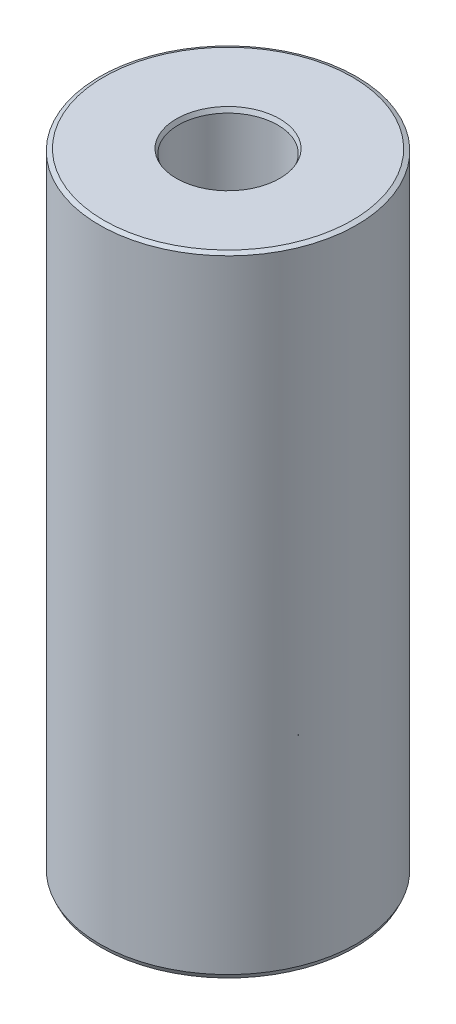
ISO-10303-21;
HEADER;
FILE_DESCRIPTION(('STEP AP214'),'2;1');
FILE_NAME('part.step','',(''),(''),'','','');
FILE_SCHEMA(('AUTOMOTIVE_DESIGN { 1 0 10303 214 1 1 1 1 }'));
ENDSEC;
DATA;
#1=APPLICATION_CONTEXT('core data for automotive mechanical design processes');
#2=APPLICATION_PROTOCOL_DEFINITION('international standard','automotive_design',2000,#1);
#3=PRODUCT_CONTEXT('',#1,'mechanical');
#4=PRODUCT('Part','Part','',(#3));
#5=PRODUCT_RELATED_PRODUCT_CATEGORY('part','',(#4));
#6=PRODUCT_DEFINITION_FORMATION('','',#4);
#7=PRODUCT_DEFINITION_CONTEXT('part definition',#1,'design');
#8=PRODUCT_DEFINITION('design','',#6,#7);
#9=PRODUCT_DEFINITION_SHAPE('','',#8);
#10=(LENGTH_UNIT() NAMED_UNIT(*) SI_UNIT(.MILLI.,.METRE.));
#11=(NAMED_UNIT(*) PLANE_ANGLE_UNIT() SI_UNIT($,.RADIAN.));
#12=(NAMED_UNIT(*) SI_UNIT($,.STERADIAN.) SOLID_ANGLE_UNIT());
#13=UNCERTAINTY_MEASURE_WITH_UNIT(LENGTH_MEASURE(1.E-05),#10,'distance_accuracy_value','');
#14=(GEOMETRIC_REPRESENTATION_CONTEXT(3) GLOBAL_UNCERTAINTY_ASSIGNED_CONTEXT((#13)) GLOBAL_UNIT_ASSIGNED_CONTEXT((#10,
#11,#12)) REPRESENTATION_CONTEXT('',''));
#15=CARTESIAN_POINT('',(0.,0.,0.));
#16=DIRECTION('',(0.,0.,1.));
#17=DIRECTION('',(1.,0.,0.));
#18=AXIS2_PLACEMENT_3D('',#15,#16,#17);
#19=CARTESIAN_POINT('',(0.,281.227169678039,0.));
#20=DIRECTION('',(0.,-1.,0.));
#21=DIRECTION('',(0.,0.,-1.));
#22=AXIS2_PLACEMENT_3D('',#19,#20,#21);
#23=CYLINDRICAL_SURFACE('',#22,57.5);
#24=CARTESIAN_POINT('',(0.,1.94524566103477,0.));
#25=DIRECTION('',(0.,1.,0.));
#26=DIRECTION('',(0.,0.,1.));
#27=AXIS2_PLACEMENT_3D('',#24,#25,#26);
#28=CIRCLE('',#27,57.5);
#29=CARTESIAN_POINT('',(0.,1.94524566103471,-57.5));
#30=VERTEX_POINT('',#29);
#31=EDGE_CURVE('E10',#30,#30,#28,.T.);
#32=CARTESIAN_POINT('',(0.,280.352056496522,0.));
#33=DIRECTION('',(0.,1.,0.));
#34=DIRECTION('',(0.,0.,1.));
#35=AXIS2_PLACEMENT_3D('',#32,#33,#34);
#36=CIRCLE('',#35,57.5);
#37=CARTESIAN_POINT('',(0.,280.352056496522,-57.5));
#38=VERTEX_POINT('',#37);
#39=EDGE_CURVE('E50',#38,#38,#36,.F.);
#40=CARTESIAN_POINT('',(0.,1.94524566103471,-57.5));
#41=CARTESIAN_POINT('',(0.,4.84531660723771,-57.5));
#42=CARTESIAN_POINT('',(0.,7.74538755344071,-57.5));
#43=CARTESIAN_POINT('',(0.,13.5455294458467,-57.5));
#44=CARTESIAN_POINT('',(0.,16.4456003920497,-57.5));
#45=CARTESIAN_POINT('',(0.,22.2457422844557,-57.5));
#46=CARTESIAN_POINT('',(0.,25.1458132306587,-57.5));
#47=CARTESIAN_POINT('',(0.,30.9459551230647,-57.5));
#48=CARTESIAN_POINT('',(0.,33.8460260692677,-57.5));
#49=CARTESIAN_POINT('',(0.,39.6461679616737,-57.5));
#50=CARTESIAN_POINT('',(0.,42.5462389078767,-57.5));
#51=CARTESIAN_POINT('',(0.,48.3463808002826,-57.5));
#52=CARTESIAN_POINT('',(0.,51.2464517464856,-57.5));
#53=CARTESIAN_POINT('',(0.,57.0465936388916,-57.5));
#54=CARTESIAN_POINT('',(0.,59.9466645850946,-57.5));
#55=CARTESIAN_POINT('',(0.,65.7468064775006,-57.5));
#56=CARTESIAN_POINT('',(0.,68.6468774237036,-57.5));
#57=CARTESIAN_POINT('',(0.,74.4470193161096,-57.5));
#58=CARTESIAN_POINT('',(0.,77.3470902623126,-57.5));
#59=CARTESIAN_POINT('',(0.,83.1472321547186,-57.5));
#60=CARTESIAN_POINT('',(0.,86.0473031009216,-57.5));
#61=CARTESIAN_POINT('',(0.,91.8474449933276,-57.5));
#62=CARTESIAN_POINT('',(0.,94.7475159395306,-57.5));
#63=CARTESIAN_POINT('',(0.,100.547657831937,-57.5));
#64=CARTESIAN_POINT('',(0.,103.44772877814,-57.5));
#65=CARTESIAN_POINT('',(0.,109.247870670546,-57.5));
#66=CARTESIAN_POINT('',(0.,112.147941616749,-57.5));
#67=CARTESIAN_POINT('',(0.,117.948083509155,-57.5));
#68=CARTESIAN_POINT('',(0.,120.848154455358,-57.5));
#69=CARTESIAN_POINT('',(0.,126.648296347764,-57.5));
#70=CARTESIAN_POINT('',(0.,129.548367293967,-57.5));
#71=CARTESIAN_POINT('',(0.,135.348509186373,-57.5));
#72=CARTESIAN_POINT('',(0.,138.248580132576,-57.5));
#73=CARTESIAN_POINT('',(0.,144.048722024982,-57.5));
#74=CARTESIAN_POINT('',(0.,146.948792971185,-57.5));
#75=CARTESIAN_POINT('',(0.,152.748934863591,-57.5));
#76=CARTESIAN_POINT('',(0.,155.649005809794,-57.5));
#77=CARTESIAN_POINT('',(0.,161.4491477022,-57.5));
#78=CARTESIAN_POINT('',(0.,164.349218648403,-57.5));
#79=CARTESIAN_POINT('',(0.,170.149360540809,-57.5));
#80=CARTESIAN_POINT('',(0.,173.049431487012,-57.5));
#81=CARTESIAN_POINT('',(0.,178.849573379418,-57.5));
#82=CARTESIAN_POINT('',(0.,181.749644325621,-57.5));
#83=CARTESIAN_POINT('',(0.,187.549786218027,-57.5));
#84=CARTESIAN_POINT('',(0.,190.44985716423,-57.5));
#85=CARTESIAN_POINT('',(0.,196.249999056636,-57.5));
#86=CARTESIAN_POINT('',(0.,199.150070002839,-57.5));
#87=CARTESIAN_POINT('',(0.,204.950211895245,-57.5));
#88=CARTESIAN_POINT('',(0.,207.850282841447,-57.5));
#89=CARTESIAN_POINT('',(0.,213.650424733853,-57.5));
#90=CARTESIAN_POINT('',(0.,216.550495680056,-57.5));
#91=CARTESIAN_POINT('',(0.,222.350637572463,-57.5));
#92=CARTESIAN_POINT('',(0.,225.250708518666,-57.5));
#93=CARTESIAN_POINT('',(0.,231.050850411071,-57.5));
#94=CARTESIAN_POINT('',(0.,233.950921357274,-57.5));
#95=CARTESIAN_POINT('',(0.,239.75106324968,-57.5));
#96=CARTESIAN_POINT('',(0.,242.651134195883,-57.5));
#97=CARTESIAN_POINT('',(0.,248.451276088289,-57.5));
#98=CARTESIAN_POINT('',(0.,251.351347034492,-57.5));
#99=CARTESIAN_POINT('',(0.,257.151488926898,-57.5));
#100=CARTESIAN_POINT('',(0.,260.051559873101,-57.5));
#101=CARTESIAN_POINT('',(0.,265.851701765507,-57.5));
#102=CARTESIAN_POINT('',(0.,268.75177271171,-57.5));
#103=CARTESIAN_POINT('',(0.,274.551914604116,-57.5));
#104=CARTESIAN_POINT('',(0.,277.451985550319,-57.5));
#105=CARTESIAN_POINT('',(0.,280.352056496522,-57.5));
#106=B_SPLINE_CURVE_WITH_KNOTS('',3,(#40,#41,#42,#43,#44,#45,#46,#47,#48,#49,#50,#51,#52,#53,
#54,#55,#56,#57,#58,#59,#60,#61,#62,#63,#64,#65,#66,#67,#68,#69,#70,#71,#72,#73,#74,#75,#76,#77,
#78,#79,#80,#81,#82,#83,#84,#85,#86,#87,#88,#89,#90,#91,#92,#93,#94,#95,#96,#97,#98,#99,#100,
#101,#102,#103,#104,#105),.UNSPECIFIED.,.F.,.F.,(4,2,2,2,2,2,2,2,2,2,2,2,2,2,2,2,2,2,2,2,2,2,2,
2,2,2,2,2,2,2,2,2,4),(0.,8.700212838609,17.400425677218,26.100638515827,34.8008513544359,
43.5010641930449,52.2012770316539,60.9014898702629,69.6017027088719,78.3019155474809,
87.0021283860899,95.7023412246989,104.402554063308,113.102766901917,121.802979740526,
130.503192579135,139.203405417744,147.903618256353,156.603831094962,165.304043933571,
174.00425677218,182.704469610789,191.404682449398,200.104895288007,208.805108126616,
217.505320965225,226.205533803834,234.905746642443,243.605959481052,252.306172319661,
261.00638515827,269.706597996879,278.406810835488),.UNSPECIFIED.);
#107=EDGE_CURVE('BSEAM39',#30,#38,#106,.T.);
#108=ORIENTED_EDGE('',*,*,#31,.T.);
#109=ORIENTED_EDGE('',*,*,#39,.T.);
#110=ORIENTED_EDGE('',*,*,#107,.T.);
#111=ORIENTED_EDGE('',*,*,#107,.F.);
#112=EDGE_LOOP('',(#108,#110,#109,#111));
#113=FACE_BOUND('',#112,.T.);
#114=ADVANCED_FACE('F39',(#113),#23,.T.);
#115=CARTESIAN_POINT('',(0.,281.227169678039,0.));
#116=DIRECTION('',(0.,1.,0.));
#117=DIRECTION('',(0.,0.,1.));
#118=AXIS2_PLACEMENT_3D('',#115,#116,#117);
#119=PLANE('',#118);
#120=CARTESIAN_POINT('',(0.,281.227169678039,0.));
#121=DIRECTION('',(0.,1.,0.));
#122=DIRECTION('',(0.,0.,1.));
#123=AXIS2_PLACEMENT_3D('',#120,#121,#122);
#124=CIRCLE('',#123,23.1044169594785);
#125=CARTESIAN_POINT('',(0.,281.227169678039,23.1044169594785));
#126=VERTEX_POINT('',#125);
#127=EDGE_CURVE('E58',#126,#126,#124,.F.);
#128=ORIENTED_EDGE('',*,*,#127,.T.);
#129=EDGE_LOOP('',(#128));
#130=FACE_BOUND('',#129,.T.);
#131=CARTESIAN_POINT('',(0.,281.227169678039,0.));
#132=DIRECTION('',(0.,1.,0.));
#133=DIRECTION('',(0.,0.,1.));
#134=AXIS2_PLACEMENT_3D('',#131,#132,#133);
#135=CIRCLE('',#134,55.5547543389664);
#136=CARTESIAN_POINT('',(0.,281.227169678039,55.5547543389664));
#137=VERTEX_POINT('',#136);
#138=EDGE_CURVE('E61',#137,#137,#135,.T.);
#139=ORIENTED_EDGE('',*,*,#138,.T.);
#140=EDGE_LOOP('',(#139));
#141=FACE_BOUND('',#140,.T.);
#142=ADVANCED_FACE('F88',(#130,#141),#119,.T.);
#143=CARTESIAN_POINT('',(0.,0.,0.));
#144=DIRECTION('',(0.,1.,0.));
#145=DIRECTION('',(0.,0.,1.));
#146=AXIS2_PLACEMENT_3D('',#143,#144,#145);
#147=PLANE('',#146);
#148=CARTESIAN_POINT('',(0.,0.,0.));
#149=DIRECTION('',(0.,1.,0.));
#150=DIRECTION('',(0.,0.,1.));
#151=AXIS2_PLACEMENT_3D('',#148,#149,#150);
#152=CIRCLE('',#151,24.1745494389948);
#153=CARTESIAN_POINT('',(0.,0.,24.1745494389948));
#154=VERTEX_POINT('',#153);
#155=EDGE_CURVE('E51',#154,#154,#152,.T.);
#156=ORIENTED_EDGE('',*,*,#155,.T.);
#157=EDGE_LOOP('',(#156));
#158=FACE_BOUND('',#157,.T.);
#159=CARTESIAN_POINT('',(0.,0.,0.));
#160=DIRECTION('',(0.,1.,0.));
#161=DIRECTION('',(0.,0.,1.));
#162=AXIS2_PLACEMENT_3D('',#159,#160,#161);
#163=CIRCLE('',#162,56.6248868184825);
#164=CARTESIAN_POINT('',(0.,0.,56.6248868184825));
#165=VERTEX_POINT('',#164);
#166=EDGE_CURVE('E54',#165,#165,#163,.F.);
#167=ORIENTED_EDGE('',*,*,#166,.T.);
#168=EDGE_LOOP('',(#167));
#169=FACE_BOUND('',#168,.T.);
#170=ADVANCED_FACE('F83',(#158,#169),#147,.F.);
#171=CARTESIAN_POINT('',(0.,281.227169678039,0.));
#172=DIRECTION('',(0.,-1.,0.));
#173=DIRECTION('',(0.,0.,-1.));
#174=AXIS2_PLACEMENT_3D('',#171,#172,#173);
#175=CYLINDRICAL_SURFACE('',#174,22.2293037779612);
#176=CARTESIAN_POINT('',(0.,279.281924017005,0.));
#177=DIRECTION('',(0.,1.,0.));
#178=DIRECTION('',(0.,0.,1.));
#179=AXIS2_PLACEMENT_3D('',#176,#177,#178);
#180=CIRCLE('',#179,22.2293037779612);
#181=CARTESIAN_POINT('',(0.,279.281924017005,-22.2293037779612));
#182=VERTEX_POINT('',#181);
#183=EDGE_CURVE('E67',#182,#182,#180,.T.);
#184=CARTESIAN_POINT('',(0.,0.875113181517007,0.));
#185=DIRECTION('',(0.,1.,0.));
#186=DIRECTION('',(0.,0.,1.));
#187=AXIS2_PLACEMENT_3D('',#184,#185,#186);
#188=CIRCLE('',#187,22.2293037779612);
#189=CARTESIAN_POINT('',(0.,0.875113181517007,-22.2293037779612));
#190=VERTEX_POINT('',#189);
#191=EDGE_CURVE('E69',#190,#190,#188,.F.);
#192=CARTESIAN_POINT('',(0.,279.281924017005,-22.2293037779612));
#193=CARTESIAN_POINT('',(0.,276.381853070802,-22.2293037779612));
#194=CARTESIAN_POINT('',(0.,273.481782124599,-22.2293037779612));
#195=CARTESIAN_POINT('',(0.,267.681640232193,-22.2293037779612));
#196=CARTESIAN_POINT('',(0.,264.78156928599,-22.2293037779612));
#197=CARTESIAN_POINT('',(0.,258.981427393584,-22.2293037779612));
#198=CARTESIAN_POINT('',(0.,256.081356447381,-22.2293037779612));
#199=CARTESIAN_POINT('',(0.,250.281214554975,-22.2293037779612));
#200=CARTESIAN_POINT('',(0.,247.381143608772,-22.2293037779612));
#201=CARTESIAN_POINT('',(0.,241.581001716366,-22.2293037779612));
#202=CARTESIAN_POINT('',(0.,238.680930770163,-22.2293037779612));
#203=CARTESIAN_POINT('',(0.,232.880788877757,-22.2293037779612));
#204=CARTESIAN_POINT('',(0.,229.980717931554,-22.2293037779612));
#205=CARTESIAN_POINT('',(0.,224.180576039148,-22.2293037779612));
#206=CARTESIAN_POINT('',(0.,221.280505092945,-22.2293037779612));
#207=CARTESIAN_POINT('',(0.,215.480363200539,-22.2293037779612));
#208=CARTESIAN_POINT('',(0.,212.580292254336,-22.2293037779612));
#209=CARTESIAN_POINT('',(0.,206.78015036193,-22.2293037779612));
#210=CARTESIAN_POINT('',(0.,203.880079415727,-22.2293037779612));
#211=CARTESIAN_POINT('',(0.,198.079937523321,-22.2293037779612));
#212=CARTESIAN_POINT('',(0.,195.179866577118,-22.2293037779612));
#213=CARTESIAN_POINT('',(0.,189.379724684712,-22.2293037779612));
#214=CARTESIAN_POINT('',(0.,186.479653738509,-22.2293037779612));
#215=CARTESIAN_POINT('',(0.,180.679511846103,-22.2293037779612));
#216=CARTESIAN_POINT('',(0.,177.7794408999,-22.2293037779612));
#217=CARTESIAN_POINT('',(0.,171.979299007494,-22.2293037779612));
#218=CARTESIAN_POINT('',(0.,169.079228061291,-22.2293037779612));
#219=CARTESIAN_POINT('',(0.,163.279086168885,-22.2293037779612));
#220=CARTESIAN_POINT('',(0.,160.379015222682,-22.2293037779612));
#221=CARTESIAN_POINT('',(0.,154.578873330276,-22.2293037779612));
#222=CARTESIAN_POINT('',(0.,151.678802384073,-22.2293037779612));
#223=CARTESIAN_POINT('',(0.,145.878660491667,-22.2293037779612));
#224=CARTESIAN_POINT('',(0.,142.978589545464,-22.2293037779612));
#225=CARTESIAN_POINT('',(0.,137.178447653058,-22.2293037779612));
#226=CARTESIAN_POINT('',(0.,134.278376706855,-22.2293037779612));
#227=CARTESIAN_POINT('',(0.,128.478234814449,-22.2293037779612));
#228=CARTESIAN_POINT('',(0.,125.578163868246,-22.2293037779612));
#229=CARTESIAN_POINT('',(0.,119.77802197584,-22.2293037779612));
#230=CARTESIAN_POINT('',(0.,116.877951029637,-22.2293037779612));
#231=CARTESIAN_POINT('',(0.,111.077809137231,-22.2293037779612));
#232=CARTESIAN_POINT('',(0.,108.177738191028,-22.2293037779612));
#233=CARTESIAN_POINT('',(0.,102.377596298622,-22.2293037779612));
#234=CARTESIAN_POINT('',(0.,99.477525352419,-22.2293037779612));
#235=CARTESIAN_POINT('',(0.,93.677383460013,-22.2293037779612));
#236=CARTESIAN_POINT('',(0.,90.7773125138099,-22.2293037779612));
#237=CARTESIAN_POINT('',(0.,84.977170621404,-22.2293037779612));
#238=CARTESIAN_POINT('',(0.,82.077099675201,-22.2293037779612));
#239=CARTESIAN_POINT('',(0.,76.276957782795,-22.2293037779612));
#240=CARTESIAN_POINT('',(0.,73.376886836592,-22.2293037779612));
#241=CARTESIAN_POINT('',(0.,67.576744944186,-22.2293037779612));
#242=CARTESIAN_POINT('',(0.,64.6766739979829,-22.2293037779612));
#243=CARTESIAN_POINT('',(0.,58.8765321055769,-22.2293037779612));
#244=CARTESIAN_POINT('',(0.,55.976461159374,-22.2293037779612));
#245=CARTESIAN_POINT('',(0.,50.176319266968,-22.2293037779612));
#246=CARTESIAN_POINT('',(0.,47.276248320765,-22.2293037779612));
#247=CARTESIAN_POINT('',(0.,41.476106428359,-22.2293037779612));
#248=CARTESIAN_POINT('',(0.,38.576035482156,-22.2293037779612));
#249=CARTESIAN_POINT('',(0.,32.77589358975,-22.2293037779612));
#250=CARTESIAN_POINT('',(0.,29.875822643547,-22.2293037779612));
#251=CARTESIAN_POINT('',(0.,24.075680751141,-22.2293037779612));
#252=CARTESIAN_POINT('',(0.,21.175609804938,-22.2293037779612));
#253=CARTESIAN_POINT('',(0.,15.375467912532,-22.2293037779612));
#254=CARTESIAN_POINT('',(0.,12.475396966329,-22.2293037779612));
#255=CARTESIAN_POINT('',(0.,6.67525507392301,-22.2293037779612));
#256=CARTESIAN_POINT('',(0.,3.77518412772001,-22.2293037779612));
#257=CARTESIAN_POINT('',(0.,0.875113181517007,-22.2293037779612));
#258=B_SPLINE_CURVE_WITH_KNOTS('',3,(#192,#193,#194,#195,#196,#197,#198,#199,#200,#201,#202,
#203,#204,#205,#206,#207,#208,#209,#210,#211,#212,#213,#214,#215,#216,#217,#218,#219,#220,#221,
#222,#223,#224,#225,#226,#227,#228,#229,#230,#231,#232,#233,#234,#235,#236,#237,#238,#239,#240,
#241,#242,#243,#244,#245,#246,#247,#248,#249,#250,#251,#252,#253,#254,#255,#256,#257),
.UNSPECIFIED.,.F.,.F.,(4,2,2,2,2,2,2,2,2,2,2,2,2,2,2,2,2,2,2,2,2,2,2,2,2,2,2,2,2,2,2,2,4),(0.,
8.700212838609,17.400425677218,26.100638515827,34.800851354436,43.501064193045,52.201277031654,
60.901489870263,69.601702708872,78.301915547481,87.00212838609,95.702341224699,104.402554063308,
113.102766901917,121.802979740526,130.503192579135,139.203405417744,147.903618256353,
156.603831094962,165.304043933571,174.00425677218,182.704469610789,191.404682449398,
200.104895288007,208.805108126616,217.505320965225,226.205533803834,234.905746642443,
243.605959481052,252.306172319661,261.00638515827,269.706597996879,278.406810835488),.UNSPECIFIED.);
#259=EDGE_CURVE('BSEAM71',#182,#190,#258,.T.);
#260=ORIENTED_EDGE('',*,*,#183,.T.);
#261=ORIENTED_EDGE('',*,*,#191,.T.);
#262=ORIENTED_EDGE('',*,*,#259,.T.);
#263=ORIENTED_EDGE('',*,*,#259,.F.);
#264=EDGE_LOOP('',(#260,#262,#261,#263));
#265=FACE_BOUND('',#264,.T.);
#266=ADVANCED_FACE('F71',(#265),#175,.F.);
#267=CARTESIAN_POINT('',(0.,279.281924017005,0.));
#268=DIRECTION('',(0.,1.,0.));
#269=DIRECTION('',(0.,0.,1.));
#270=AXIS2_PLACEMENT_3D('',#267,#268,#269);
#271=CONICAL_SURFACE('',#270,22.2293037779612,0.422748171100938);
#272=ORIENTED_EDGE('',*,*,#127,.F.);
#273=EDGE_LOOP('',(#272));
#274=FACE_BOUND('',#273,.T.);
#275=ORIENTED_EDGE('',*,*,#183,.F.);
#276=EDGE_LOOP('',(#275));
#277=FACE_BOUND('',#276,.T.);
#278=ADVANCED_FACE('F77',(#274,#277),#271,.F.);
#279=CARTESIAN_POINT('',(0.,0.,0.));
#280=DIRECTION('',(0.,-1.,0.));
#281=DIRECTION('',(0.,0.,-1.));
#282=AXIS2_PLACEMENT_3D('',#279,#280,#281);
#283=CONICAL_SURFACE('',#282,24.1745494389948,1.14804815569393);
#284=ORIENTED_EDGE('',*,*,#191,.F.);
#285=EDGE_LOOP('',(#284));
#286=FACE_BOUND('',#285,.T.);
#287=ORIENTED_EDGE('',*,*,#155,.F.);
#288=EDGE_LOOP('',(#287));
#289=FACE_BOUND('',#288,.T.);
#290=ADVANCED_FACE('F73',(#286,#289),#283,.F.);
#291=CARTESIAN_POINT('',(0.,1.94524566103477,0.));
#292=DIRECTION('',(0.,1.,0.));
#293=DIRECTION('',(0.,0.,1.));
#294=AXIS2_PLACEMENT_3D('',#291,#292,#293);
#295=CONICAL_SURFACE('',#294,57.5,0.422748171100954);
#296=ORIENTED_EDGE('',*,*,#166,.F.);
#297=EDGE_LOOP('',(#296));
#298=FACE_BOUND('',#297,.T.);
#299=ORIENTED_EDGE('',*,*,#31,.F.);
#300=EDGE_LOOP('',(#299));
#301=FACE_BOUND('',#300,.T.);
#302=ADVANCED_FACE('F76',(#298,#301),#295,.T.);
#303=CARTESIAN_POINT('',(0.,281.227169678039,0.));
#304=DIRECTION('',(0.,-1.,0.));
#305=DIRECTION('',(0.,0.,-1.));
#306=AXIS2_PLACEMENT_3D('',#303,#304,#305);
#307=CONICAL_SURFACE('',#306,55.5547543389664,1.14804815569394);
#308=ORIENTED_EDGE('',*,*,#39,.F.);
#309=EDGE_LOOP('',(#308));
#310=FACE_BOUND('',#309,.T.);
#311=ORIENTED_EDGE('',*,*,#138,.F.);
#312=EDGE_LOOP('',(#311));
#313=FACE_BOUND('',#312,.T.);
#314=ADVANCED_FACE('F45',(#310,#313),#307,.T.);
#315=CLOSED_SHELL('',(#114,#142,#170,#266,#278,#290,#302,#314));
#316=MANIFOLD_SOLID_BREP('B2',#315);
#317=ADVANCED_BREP_SHAPE_REPRESENTATION('',(#18,#316),#14);
#318=SHAPE_DEFINITION_REPRESENTATION(#9,#317);
ENDSEC;
END-ISO-10303-21;
